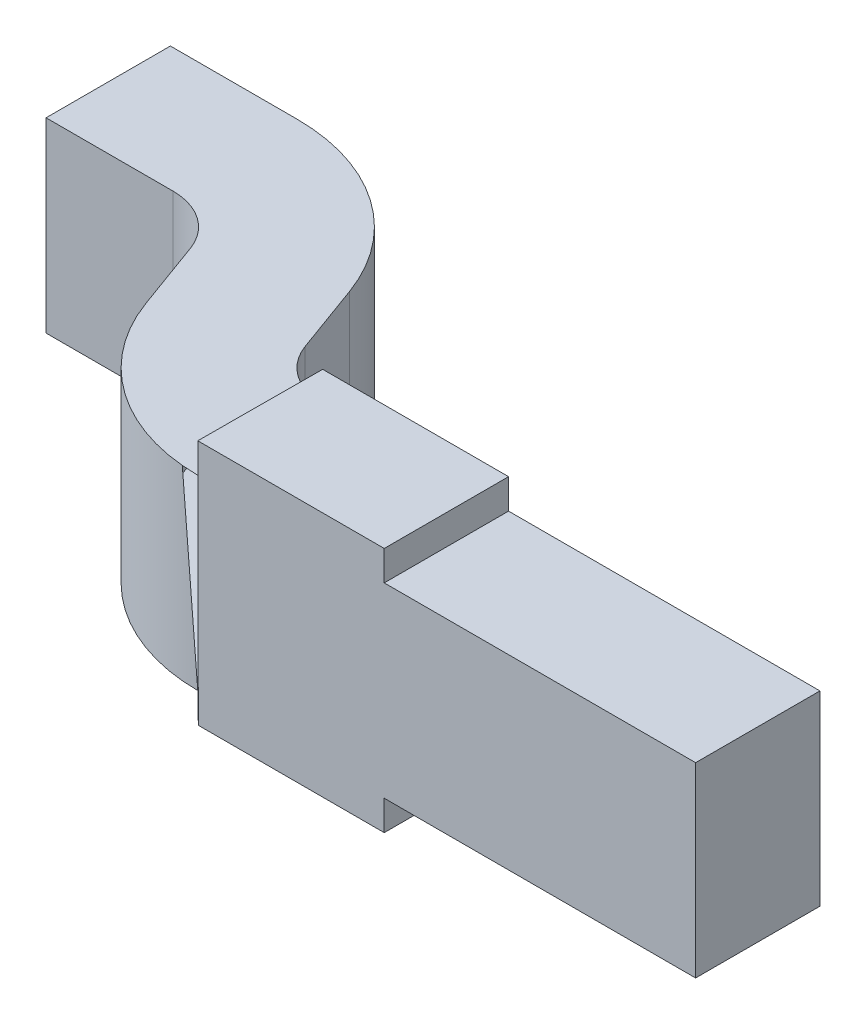
ISO-10303-21;
HEADER;
FILE_DESCRIPTION(('STEP AP214'),'2;1');
FILE_NAME('part.step','',(''),(''),'','','');
FILE_SCHEMA(('AUTOMOTIVE_DESIGN { 1 0 10303 214 1 1 1 1 }'));
ENDSEC;
DATA;
#1=APPLICATION_CONTEXT('core data for automotive mechanical design processes');
#2=APPLICATION_PROTOCOL_DEFINITION('international standard','automotive_design',2000,#1);
#3=PRODUCT_CONTEXT('',#1,'mechanical');
#4=PRODUCT('Part','Part','',(#3));
#5=PRODUCT_RELATED_PRODUCT_CATEGORY('part','',(#4));
#6=PRODUCT_DEFINITION_FORMATION('','',#4);
#7=PRODUCT_DEFINITION_CONTEXT('part definition',#1,'design');
#8=PRODUCT_DEFINITION('design','',#6,#7);
#9=PRODUCT_DEFINITION_SHAPE('','',#8);
#10=(LENGTH_UNIT() NAMED_UNIT(*) SI_UNIT(.MILLI.,.METRE.));
#11=(NAMED_UNIT(*) PLANE_ANGLE_UNIT() SI_UNIT($,.RADIAN.));
#12=(NAMED_UNIT(*) SI_UNIT($,.STERADIAN.) SOLID_ANGLE_UNIT());
#13=UNCERTAINTY_MEASURE_WITH_UNIT(LENGTH_MEASURE(1.E-05),#10,'distance_accuracy_value','');
#14=(GEOMETRIC_REPRESENTATION_CONTEXT(3) GLOBAL_UNCERTAINTY_ASSIGNED_CONTEXT((#13)) GLOBAL_UNIT_ASSIGNED_CONTEXT((#10,
#11,#12)) REPRESENTATION_CONTEXT('',''));
#15=CARTESIAN_POINT('',(0.,0.,0.));
#16=DIRECTION('',(0.,0.,1.));
#17=DIRECTION('',(1.,0.,0.));
#18=AXIS2_PLACEMENT_3D('',#15,#16,#17);
#19=CARTESIAN_POINT('',(195.3553175894,103.43704329235,113.086328634145));
#20=DIRECTION('',(0.,1.,0.));
#21=DIRECTION('',(1.,0.,0.));
#22=AXIS2_PLACEMENT_3D('',#19,#20,#21);
#23=PLANE('',#22);
#24=DIRECTION('',(-1.,0.,0.));
#25=VECTOR('',#24,1.);
#26=CARTESIAN_POINT('',(197.209042943722,103.43704329235,113.151470551509));
#27=LINE('',#26,#25);
#28=CARTESIAN_POINT('',(197.209042943722,103.43704329235,113.151470551509));
#29=VERTEX_POINT('',#28);
#30=CARTESIAN_POINT('',(195.956744279938,103.43704329235,113.151470551509));
#31=VERTEX_POINT('',#30);
#32=EDGE_CURVE('E67',#29,#31,#27,.T.);
#33=ORIENTED_EDGE('',*,*,#32,.F.);
#34=DIRECTION('',(0.,0.,-1.));
#35=VECTOR('',#34,1.);
#36=CARTESIAN_POINT('',(197.209042943722,103.43704329235,113.651470551509));
#37=LINE('',#36,#35);
#38=CARTESIAN_POINT('',(197.209042943722,103.43704329235,113.651470551509));
#39=VERTEX_POINT('',#38);
#40=EDGE_CURVE('E354',#39,#29,#37,.T.);
#41=ORIENTED_EDGE('',*,*,#40,.F.);
#42=DIRECTION('',(1.,0.,0.));
#43=VECTOR('',#42,1.);
#44=CARTESIAN_POINT('',(195.209042943722,103.43704329235,113.651470551509));
#45=LINE('',#44,#43);
#46=CARTESIAN_POINT('',(195.956744279938,103.43704329235,113.651470551509));
#47=VERTEX_POINT('',#46);
#48=EDGE_CURVE('E318',#47,#39,#45,.T.);
#49=ORIENTED_EDGE('',*,*,#48,.F.);
#50=DIRECTION('',(0.,0.,-1.));
#51=VECTOR('',#50,1.);
#52=CARTESIAN_POINT('',(195.956744279938,103.43704329235,112.648955771372));
#53=LINE('',#52,#51);
#54=EDGE_CURVE('E11',#47,#31,#53,.T.);
#55=ORIENTED_EDGE('',*,*,#54,.T.);
#56=EDGE_LOOP('',(#33,#41,#49,#55));
#57=FACE_BOUND('',#56,.T.);
#58=ADVANCED_FACE('F44',(#57),#23,.F.);
#59=CARTESIAN_POINT('',(195.956744279938,104.78204329235,112.211582908599));
#60=DIRECTION('',(1.,0.,0.));
#61=DIRECTION('',(0.,1.,0.));
#62=AXIS2_PLACEMENT_3D('',#59,#60,#61);
#63=PLANE('',#62);
#64=ORIENTED_EDGE('',*,*,#54,.F.);
#65=DIRECTION('',(0.,1.,0.));
#66=VECTOR('',#65,1.);
#67=CARTESIAN_POINT('',(195.956744279938,104.54454329235,113.651470551509));
#68=LINE('',#67,#66);
#69=CARTESIAN_POINT('',(195.956744279938,103.31704329235,113.651470551509));
#70=VERTEX_POINT('',#69);
#71=EDGE_CURVE('E218',#70,#47,#68,.T.);
#72=ORIENTED_EDGE('',*,*,#71,.F.);
#73=DIRECTION('',(0.,0.,-1.));
#74=VECTOR('',#73,1.);
#75=CARTESIAN_POINT('',(195.956744279938,103.31704329235,112.648955771372));
#76=LINE('',#75,#74);
#77=CARTESIAN_POINT('',(195.956744279938,103.31704329235,113.151470551509));
#78=VERTEX_POINT('',#77);
#79=EDGE_CURVE('E55',#70,#78,#76,.T.);
#80=ORIENTED_EDGE('',*,*,#79,.T.);
#81=DIRECTION('',(0.,-1.,0.));
#82=VECTOR('',#81,1.);
#83=CARTESIAN_POINT('',(195.956744279938,104.54454329235,113.151470551509));
#84=LINE('',#83,#82);
#85=EDGE_CURVE('E202',#31,#78,#84,.T.);
#86=ORIENTED_EDGE('',*,*,#85,.F.);
#87=EDGE_LOOP('',(#64,#72,#80,#86));
#88=FACE_BOUND('',#87,.T.);
#89=ADVANCED_FACE('F216',(#88),#63,.T.);
#90=CARTESIAN_POINT('',(195.3553175894,103.31704329235,113.086328634145));
#91=DIRECTION('',(0.,1.,0.));
#92=DIRECTION('',(1.,0.,0.));
#93=AXIS2_PLACEMENT_3D('',#90,#91,#92);
#94=PLANE('',#93);
#95=DIRECTION('',(-1.,0.,0.));
#96=VECTOR('',#95,1.);
#97=CARTESIAN_POINT('',(197.209042943722,103.31704329235,113.151470551509));
#98=LINE('',#97,#96);
#99=CARTESIAN_POINT('',(195.209042943722,103.31704329235,113.151470551509));
#100=VERTEX_POINT('',#99);
#101=EDGE_CURVE('E208',#78,#100,#98,.T.);
#102=ORIENTED_EDGE('',*,*,#101,.F.);
#103=ORIENTED_EDGE('',*,*,#79,.F.);
#104=DIRECTION('',(1.,0.,0.));
#105=VECTOR('',#104,1.);
#106=CARTESIAN_POINT('',(195.209042943722,103.31704329235,113.651470551509));
#107=LINE('',#106,#105);
#108=CARTESIAN_POINT('',(195.209042943722,103.31704329235,113.651470551509));
#109=VERTEX_POINT('',#108);
#110=EDGE_CURVE('E418',#109,#70,#107,.T.);
#111=ORIENTED_EDGE('',*,*,#110,.F.);
#112=DIRECTION('',(0.,0.,1.));
#113=VECTOR('',#112,1.);
#114=CARTESIAN_POINT('',(195.206744279938,103.31704329235,112.648955771372));
#115=LINE('',#114,#113);
#116=EDGE_CURVE('E222',#100,#109,#115,.T.);
#117=ORIENTED_EDGE('',*,*,#116,.F.);
#118=EDGE_LOOP('',(#102,#103,#111,#117));
#119=FACE_BOUND('',#118,.T.);
#120=ADVANCED_FACE('F224',(#119),#94,.F.);
#121=CARTESIAN_POINT('',(195.206744279938,98.2820432923502,112.211582908599));
#122=DIRECTION('',(-1.,0.,0.));
#123=DIRECTION('',(0.,0.,1.));
#124=AXIS2_PLACEMENT_3D('',#121,#122,#123);
#125=PLANE('',#124);
#126=DIRECTION('',(0.,0.,1.));
#127=VECTOR('',#126,1.);
#128=CARTESIAN_POINT('',(195.206744279938,103.43704329235,112.648955771372));
#129=LINE('',#128,#127);
#130=CARTESIAN_POINT('',(195.206744279938,103.43704329235,113.151459983575));
#131=VERTEX_POINT('',#130);
#132=CARTESIAN_POINT('',(195.206744279938,103.43704329235,113.651467028931));
#133=VERTEX_POINT('',#132);
#134=EDGE_CURVE('E366',#131,#133,#129,.T.);
#135=ORIENTED_EDGE('',*,*,#134,.F.);
#136=DIRECTION('',(0.,1.,0.));
#137=VECTOR('',#136,1.);
#138=CARTESIAN_POINT('',(195.206744279938,104.30704329235,113.151459983575));
#139=LINE('',#138,#137);
#140=EDGE_CURVE('E234',#100,#131,#139,.T.);
#141=ORIENTED_EDGE('',*,*,#140,.F.);
#142=ORIENTED_EDGE('',*,*,#116,.T.);
#143=DIRECTION('',(0.,1.,0.));
#144=VECTOR('',#143,1.);
#145=CARTESIAN_POINT('',(195.206744279938,104.30704329235,113.651467028931));
#146=LINE('',#145,#144);
#147=EDGE_CURVE('E369',#109,#133,#146,.T.);
#148=ORIENTED_EDGE('',*,*,#147,.T.);
#149=EDGE_LOOP('',(#135,#141,#142,#148));
#150=FACE_BOUND('',#149,.T.);
#151=ADVANCED_FACE('F511',(#150),#125,.T.);
#152=CARTESIAN_POINT('',(195.3553175894,103.43704329235,113.086328634145));
#153=DIRECTION('',(0.,1.,0.));
#154=DIRECTION('',(1.,0.,0.));
#155=AXIS2_PLACEMENT_3D('',#152,#153,#154);
#156=PLANE('',#155);
#157=DIRECTION('',(-1.,0.,0.));
#158=VECTOR('',#157,1.);
#159=CARTESIAN_POINT('',(194.166744279938,103.43704329235,112.211582908599));
#160=LINE('',#159,#158);
#161=CARTESIAN_POINT('',(194.166744279938,103.43704329235,112.211582908599));
#162=VERTEX_POINT('',#161);
#163=CARTESIAN_POINT('',(193.656744279938,103.43704329235,112.211582908599));
#164=VERTEX_POINT('',#163);
#165=EDGE_CURVE('E396',#162,#164,#160,.T.);
#166=ORIENTED_EDGE('',*,*,#165,.F.);
#167=CARTESIAN_POINT('',(194.166744279938,103.43704329235,112.961582908599));
#168=DIRECTION('',(0.,1.,0.));
#169=DIRECTION('',(0.939692620785816,0.,-0.342020143325922));
#170=AXIS2_PLACEMENT_3D('',#167,#168,#169);
#171=CIRCLE('',#170,0.75);
#172=CARTESIAN_POINT('',(194.871513745527,103.43704329235,112.705067801105));
#173=VERTEX_POINT('',#172);
#174=EDGE_CURVE('E357',#173,#162,#171,.T.);
#175=ORIENTED_EDGE('',*,*,#174,.F.);
#176=DIRECTION('',(-0.342020143325932,0.,-0.939692620785813));
#177=VECTOR('',#176,1.);
#178=CARTESIAN_POINT('',(194.974119788525,103.43704329235,112.986975587341));
#179=LINE('',#178,#177);
#180=CARTESIAN_POINT('',(194.974119788525,103.43704329235,112.986975587341));
#181=VERTEX_POINT('',#180);
#182=EDGE_CURVE('E305',#181,#173,#179,.T.);
#183=ORIENTED_EDGE('',*,*,#182,.F.);
#184=CARTESIAN_POINT('',(195.209042943722,103.43704329235,112.901470551509));
#185=DIRECTION('',(0.,-1.,0.));
#186=DIRECTION('',(0.,0.,1.));
#187=AXIS2_PLACEMENT_3D('',#184,#185,#186);
#188=CIRCLE('',#187,0.25);
#189=EDGE_CURVE('E270',#131,#181,#188,.T.);
#190=ORIENTED_EDGE('',*,*,#189,.F.);
#191=ORIENTED_EDGE('',*,*,#134,.T.);
#192=CARTESIAN_POINT('',(195.209042943722,103.43704329235,112.901470551509));
#193=DIRECTION('',(0.,1.,0.));
#194=DIRECTION('',(-0.939692620785816,0.,0.342020143325922));
#195=AXIS2_PLACEMENT_3D('',#192,#193,#194);
#196=CIRCLE('',#195,0.75);
#197=CARTESIAN_POINT('',(194.504273478132,103.43704329235,113.157985659003));
#198=VERTEX_POINT('',#197);
#199=EDGE_CURVE('E325',#198,#133,#196,.T.);
#200=ORIENTED_EDGE('',*,*,#199,.F.);
#201=DIRECTION('',(0.342020143325932,0.,0.939692620785813));
#202=VECTOR('',#201,1.);
#203=CARTESIAN_POINT('',(194.401667435134,103.43704329235,112.876077872768));
#204=LINE('',#203,#202);
#205=CARTESIAN_POINT('',(194.401667435134,103.43704329235,112.876077872768));
#206=VERTEX_POINT('',#205);
#207=EDGE_CURVE('E314',#206,#198,#204,.T.);
#208=ORIENTED_EDGE('',*,*,#207,.F.);
#209=CARTESIAN_POINT('',(194.166744279938,103.43704329235,112.961582908599));
#210=DIRECTION('',(0.,-1.,0.));
#211=DIRECTION('',(0.,0.,-1.));
#212=AXIS2_PLACEMENT_3D('',#209,#210,#211);
#213=CIRCLE('',#212,0.25);
#214=CARTESIAN_POINT('',(194.166744279938,103.43704329235,112.711582908599));
#215=VERTEX_POINT('',#214);
#216=EDGE_CURVE('E292',#215,#206,#213,.T.);
#217=ORIENTED_EDGE('',*,*,#216,.F.);
#218=DIRECTION('',(1.,0.,0.));
#219=VECTOR('',#218,1.);
#220=CARTESIAN_POINT('',(193.656744279938,103.43704329235,112.711582908599));
#221=LINE('',#220,#219);
#222=CARTESIAN_POINT('',(193.656744279938,103.43704329235,112.711582908599));
#223=VERTEX_POINT('',#222);
#224=EDGE_CURVE('E291',#223,#215,#221,.T.);
#225=ORIENTED_EDGE('',*,*,#224,.F.);
#226=DIRECTION('',(0.,0.,1.));
#227=VECTOR('',#226,1.);
#228=CARTESIAN_POINT('',(193.656744279938,103.43704329235,112.211582908599));
#229=LINE('',#228,#227);
#230=EDGE_CURVE('E330',#164,#223,#229,.T.);
#231=ORIENTED_EDGE('',*,*,#230,.F.);
#232=EDGE_LOOP('',(#166,#175,#183,#190,#191,#200,#208,#217,#225,#231));
#233=FACE_BOUND('',#232,.T.);
#234=ADVANCED_FACE('F461',(#233),#156,.F.);
#235=CARTESIAN_POINT('',(193.656744279938,104.18704329235,112.711582908599));
#236=DIRECTION('',(0.,0.,1.));
#237=DIRECTION('',(1.,0.,0.));
#238=AXIS2_PLACEMENT_3D('',#235,#236,#237);
#239=PLANE('',#238);
#240=DIRECTION('',(0.,-1.,0.));
#241=VECTOR('',#240,1.);
#242=CARTESIAN_POINT('',(193.656744279938,104.18704329235,112.711582908599));
#243=LINE('',#242,#241);
#244=CARTESIAN_POINT('',(193.656744279938,104.18704329235,112.711582908599));
#245=VERTEX_POINT('',#244);
#246=EDGE_CURVE('E370',#245,#223,#243,.T.);
#247=ORIENTED_EDGE('',*,*,#246,.T.);
#248=ORIENTED_EDGE('',*,*,#224,.T.);
#249=DIRECTION('',(0.,-1.,0.));
#250=VECTOR('',#249,1.);
#251=CARTESIAN_POINT('',(194.166744279938,104.18704329235,112.711582908599));
#252=LINE('',#251,#250);
#253=CARTESIAN_POINT('',(194.166744279938,104.18704329235,112.711582908599));
#254=VERTEX_POINT('',#253);
#255=EDGE_CURVE('E288',#254,#215,#252,.T.);
#256=ORIENTED_EDGE('',*,*,#255,.F.);
#257=DIRECTION('',(1.,0.,0.));
#258=VECTOR('',#257,1.);
#259=CARTESIAN_POINT('',(193.656744279938,104.18704329235,112.711582908599));
#260=LINE('',#259,#258);
#261=EDGE_CURVE('E339',#245,#254,#260,.T.);
#262=ORIENTED_EDGE('',*,*,#261,.F.);
#263=EDGE_LOOP('',(#247,#248,#256,#262));
#264=FACE_BOUND('',#263,.T.);
#265=ADVANCED_FACE('F468',(#264),#239,.T.);
#266=CARTESIAN_POINT('',(194.166744279938,104.18704329235,112.961582908599));
#267=DIRECTION('',(0.,1.,0.));
#268=DIRECTION('',(0.,0.,-1.));
#269=AXIS2_PLACEMENT_3D('',#266,#267,#268);
#270=CYLINDRICAL_SURFACE('',#269,0.25);
#271=ORIENTED_EDGE('',*,*,#255,.T.);
#272=ORIENTED_EDGE('',*,*,#216,.T.);
#273=DIRECTION('',(0.,-1.,0.));
#274=VECTOR('',#273,1.);
#275=CARTESIAN_POINT('',(194.401667435134,104.18704329235,112.876077872768));
#276=LINE('',#275,#274);
#277=CARTESIAN_POINT('',(194.401667435134,104.18704329235,112.876077872768));
#278=VERTEX_POINT('',#277);
#279=EDGE_CURVE('E296',#278,#206,#276,.T.);
#280=ORIENTED_EDGE('',*,*,#279,.F.);
#281=CARTESIAN_POINT('',(194.166744279938,104.18704329235,112.961582908599));
#282=DIRECTION('',(0.,-1.,0.));
#283=DIRECTION('',(0.,0.,-1.));
#284=AXIS2_PLACEMENT_3D('',#281,#282,#283);
#285=CIRCLE('',#284,0.25);
#286=EDGE_CURVE('E343',#254,#278,#285,.T.);
#287=ORIENTED_EDGE('',*,*,#286,.F.);
#288=EDGE_LOOP('',(#271,#272,#280,#287));
#289=FACE_BOUND('',#288,.T.);
#290=ADVANCED_FACE('F464',(#289),#270,.F.);
#291=CARTESIAN_POINT('',(194.401667435134,104.18704329235,112.876077872768));
#292=DIRECTION('',(-0.939692620785813,0.,0.342020143325932));
#293=DIRECTION('',(0.,1.,0.));
#294=AXIS2_PLACEMENT_3D('',#291,#292,#293);
#295=PLANE('',#294);
#296=ORIENTED_EDGE('',*,*,#279,.T.);
#297=ORIENTED_EDGE('',*,*,#207,.T.);
#298=DIRECTION('',(0.,-1.,0.));
#299=VECTOR('',#298,1.);
#300=CARTESIAN_POINT('',(194.504273478132,104.18704329235,113.157985659003));
#301=LINE('',#300,#299);
#302=CARTESIAN_POINT('',(194.504273478132,104.18704329235,113.157985659003));
#303=VERTEX_POINT('',#302);
#304=EDGE_CURVE('E256',#303,#198,#301,.T.);
#305=ORIENTED_EDGE('',*,*,#304,.F.);
#306=DIRECTION('',(0.342020143325932,0.,0.939692620785813));
#307=VECTOR('',#306,1.);
#308=CARTESIAN_POINT('',(194.401667435134,104.18704329235,112.876077872768));
#309=LINE('',#308,#307);
#310=EDGE_CURVE('E352',#278,#303,#309,.T.);
#311=ORIENTED_EDGE('',*,*,#310,.F.);
#312=EDGE_LOOP('',(#296,#297,#305,#311));
#313=FACE_BOUND('',#312,.T.);
#314=ADVANCED_FACE('F458',(#313),#295,.T.);
#315=CARTESIAN_POINT('',(194.974119788525,104.18704329235,112.986975587341));
#316=DIRECTION('',(0.939692620785813,0.,-0.342020143325932));
#317=DIRECTION('',(0.,-1.,0.));
#318=AXIS2_PLACEMENT_3D('',#315,#316,#317);
#319=PLANE('',#318);
#320=DIRECTION('',(0.,-1.,0.));
#321=VECTOR('',#320,1.);
#322=CARTESIAN_POINT('',(194.974119788525,104.18704329235,112.986975587341));
#323=LINE('',#322,#321);
#324=CARTESIAN_POINT('',(194.974119788525,104.18704329235,112.986975587341));
#325=VERTEX_POINT('',#324);
#326=EDGE_CURVE('E309',#325,#181,#323,.T.);
#327=ORIENTED_EDGE('',*,*,#326,.T.);
#328=ORIENTED_EDGE('',*,*,#182,.T.);
#329=DIRECTION('',(0.,-1.,0.));
#330=VECTOR('',#329,1.);
#331=CARTESIAN_POINT('',(194.871513745527,104.18704329235,112.705067801105));
#332=LINE('',#331,#330);
#333=CARTESIAN_POINT('',(194.871513745527,104.18704329235,112.705067801105));
#334=VERTEX_POINT('',#333);
#335=EDGE_CURVE('E310',#334,#173,#332,.T.);
#336=ORIENTED_EDGE('',*,*,#335,.F.);
#337=DIRECTION('',(-0.342020143325932,0.,-0.939692620785813));
#338=VECTOR('',#337,1.);
#339=CARTESIAN_POINT('',(194.974119788525,104.18704329235,112.986975587341));
#340=LINE('',#339,#338);
#341=EDGE_CURVE('E365',#325,#334,#340,.T.);
#342=ORIENTED_EDGE('',*,*,#341,.F.);
#343=EDGE_LOOP('',(#327,#328,#336,#342));
#344=FACE_BOUND('',#343,.T.);
#345=ADVANCED_FACE('F485',(#344),#319,.T.);
#346=CARTESIAN_POINT('',(194.166744279938,104.18704329235,112.961582908599));
#347=DIRECTION('',(0.,1.,0.));
#348=DIRECTION('',(0.939692620785816,0.,-0.342020143325922));
#349=AXIS2_PLACEMENT_3D('',#346,#347,#348);
#350=CYLINDRICAL_SURFACE('',#349,0.75);
#351=ORIENTED_EDGE('',*,*,#335,.T.);
#352=ORIENTED_EDGE('',*,*,#174,.T.);
#353=DIRECTION('',(0.,-1.,0.));
#354=VECTOR('',#353,1.);
#355=CARTESIAN_POINT('',(194.166744279938,104.18704329235,112.211582908599));
#356=LINE('',#355,#354);
#357=CARTESIAN_POINT('',(194.166744279938,104.18704329235,112.211582908599));
#358=VERTEX_POINT('',#357);
#359=EDGE_CURVE('E361',#358,#162,#356,.T.);
#360=ORIENTED_EDGE('',*,*,#359,.F.);
#361=CARTESIAN_POINT('',(194.166744279938,104.18704329235,112.961582908599));
#362=DIRECTION('',(0.,1.,0.));
#363=DIRECTION('',(0.939692620785816,0.,-0.342020143325922));
#364=AXIS2_PLACEMENT_3D('',#361,#362,#363);
#365=CIRCLE('',#364,0.75);
#366=EDGE_CURVE('E300',#334,#358,#365,.T.);
#367=ORIENTED_EDGE('',*,*,#366,.F.);
#368=EDGE_LOOP('',(#351,#352,#360,#367));
#369=FACE_BOUND('',#368,.T.);
#370=ADVANCED_FACE('F482',(#369),#350,.T.);
#371=CARTESIAN_POINT('',(194.166744279938,104.18704329235,112.211582908599));
#372=DIRECTION('',(0.,0.,-1.));
#373=DIRECTION('',(0.,-1.,0.));
#374=AXIS2_PLACEMENT_3D('',#371,#372,#373);
#375=PLANE('',#374);
#376=ORIENTED_EDGE('',*,*,#359,.T.);
#377=ORIENTED_EDGE('',*,*,#165,.T.);
#378=DIRECTION('',(0.,-1.,0.));
#379=VECTOR('',#378,1.);
#380=CARTESIAN_POINT('',(193.656744279938,104.18704329235,112.211582908599));
#381=LINE('',#380,#379);
#382=CARTESIAN_POINT('',(193.656744279938,104.18704329235,112.211582908599));
#383=VERTEX_POINT('',#382);
#384=EDGE_CURVE('E333',#383,#164,#381,.T.);
#385=ORIENTED_EDGE('',*,*,#384,.F.);
#386=DIRECTION('',(-1.,0.,0.));
#387=VECTOR('',#386,1.);
#388=CARTESIAN_POINT('',(194.166744279938,104.18704329235,112.211582908599));
#389=LINE('',#388,#387);
#390=EDGE_CURVE('E297',#358,#383,#389,.T.);
#391=ORIENTED_EDGE('',*,*,#390,.F.);
#392=EDGE_LOOP('',(#376,#377,#385,#391));
#393=FACE_BOUND('',#392,.T.);
#394=ADVANCED_FACE('F474',(#393),#375,.T.);
#395=CARTESIAN_POINT('',(193.656744279938,104.18704329235,112.211582908599));
#396=DIRECTION('',(-1.,0.,0.));
#397=DIRECTION('',(0.,1.,0.));
#398=AXIS2_PLACEMENT_3D('',#395,#396,#397);
#399=PLANE('',#398);
#400=ORIENTED_EDGE('',*,*,#384,.T.);
#401=ORIENTED_EDGE('',*,*,#230,.T.);
#402=ORIENTED_EDGE('',*,*,#246,.F.);
#403=DIRECTION('',(0.,0.,1.));
#404=VECTOR('',#403,1.);
#405=CARTESIAN_POINT('',(193.656744279938,104.18704329235,112.211582908599));
#406=LINE('',#405,#404);
#407=EDGE_CURVE('E342',#383,#245,#406,.T.);
#408=ORIENTED_EDGE('',*,*,#407,.F.);
#409=EDGE_LOOP('',(#400,#401,#402,#408));
#410=FACE_BOUND('',#409,.T.);
#411=ADVANCED_FACE('F478',(#410),#399,.T.);
#412=CARTESIAN_POINT('',(197.209042943722,104.18704329235,113.651470551509));
#413=DIRECTION('',(1.,0.,0.));
#414=DIRECTION('',(0.,1.,0.));
#415=AXIS2_PLACEMENT_3D('',#412,#413,#414);
#416=PLANE('',#415);
#417=DIRECTION('',(0.,-1.,0.));
#418=VECTOR('',#417,1.);
#419=CARTESIAN_POINT('',(197.209042943722,104.18704329235,113.651470551509));
#420=LINE('',#419,#418);
#421=CARTESIAN_POINT('',(197.209042943722,104.18704329235,113.651470551509));
#422=VERTEX_POINT('',#421);
#423=EDGE_CURVE('E334',#422,#39,#420,.T.);
#424=ORIENTED_EDGE('',*,*,#423,.T.);
#425=ORIENTED_EDGE('',*,*,#40,.T.);
#426=DIRECTION('',(0.,-1.,0.));
#427=VECTOR('',#426,1.);
#428=CARTESIAN_POINT('',(197.209042943722,104.18704329235,113.151470551509));
#429=LINE('',#428,#427);
#430=CARTESIAN_POINT('',(197.209042943722,104.18704329235,113.151470551509));
#431=VERTEX_POINT('',#430);
#432=EDGE_CURVE('E311',#431,#29,#429,.T.);
#433=ORIENTED_EDGE('',*,*,#432,.F.);
#434=DIRECTION('',(0.,0.,-1.));
#435=VECTOR('',#434,1.);
#436=CARTESIAN_POINT('',(197.209042943722,104.18704329235,113.651470551509));
#437=LINE('',#436,#435);
#438=EDGE_CURVE('E347',#422,#431,#437,.T.);
#439=ORIENTED_EDGE('',*,*,#438,.F.);
#440=EDGE_LOOP('',(#424,#425,#433,#439));
#441=FACE_BOUND('',#440,.T.);
#442=ADVANCED_FACE('F541',(#441),#416,.T.);
#443=CARTESIAN_POINT('',(195.3553175894,104.18704329235,113.086328634145));
#444=DIRECTION('',(0.,1.,0.));
#445=DIRECTION('',(1.,0.,0.));
#446=AXIS2_PLACEMENT_3D('',#443,#444,#445);
#447=PLANE('',#446);
#448=ORIENTED_EDGE('',*,*,#407,.T.);
#449=ORIENTED_EDGE('',*,*,#261,.T.);
#450=ORIENTED_EDGE('',*,*,#286,.T.);
#451=ORIENTED_EDGE('',*,*,#310,.T.);
#452=CARTESIAN_POINT('',(195.209042943722,104.18704329235,112.901470551509));
#453=DIRECTION('',(0.,1.,0.));
#454=DIRECTION('',(-0.939692620785816,0.,0.342020143325922));
#455=AXIS2_PLACEMENT_3D('',#452,#453,#454);
#456=CIRCLE('',#455,0.75);
#457=CARTESIAN_POINT('',(195.206744279938,104.18704329235,113.651467028931));
#458=VERTEX_POINT('',#457);
#459=EDGE_CURVE('E348',#303,#458,#456,.T.);
#460=ORIENTED_EDGE('',*,*,#459,.T.);
#461=DIRECTION('',(0.,0.,1.));
#462=VECTOR('',#461,1.);
#463=CARTESIAN_POINT('',(195.206744279938,104.18704329235,112.648955771372));
#464=LINE('',#463,#462);
#465=CARTESIAN_POINT('',(195.206744279938,104.18704329235,113.151459983575));
#466=VERTEX_POINT('',#465);
#467=EDGE_CURVE('E255',#466,#458,#464,.T.);
#468=ORIENTED_EDGE('',*,*,#467,.F.);
#469=CARTESIAN_POINT('',(195.209042943722,104.18704329235,112.901470551509));
#470=DIRECTION('',(0.,-1.,0.));
#471=DIRECTION('',(0.,0.,1.));
#472=AXIS2_PLACEMENT_3D('',#469,#470,#471);
#473=CIRCLE('',#472,0.25);
#474=EDGE_CURVE('E353',#466,#325,#473,.T.);
#475=ORIENTED_EDGE('',*,*,#474,.T.);
#476=ORIENTED_EDGE('',*,*,#341,.T.);
#477=ORIENTED_EDGE('',*,*,#366,.T.);
#478=ORIENTED_EDGE('',*,*,#390,.T.);
#479=EDGE_LOOP('',(#448,#449,#450,#451,#460,#468,#475,#476,#477,#478));
#480=FACE_BOUND('',#479,.T.);
#481=ADVANCED_FACE('F455',(#480),#447,.T.);
#482=CARTESIAN_POINT('',(195.3553175894,104.18704329235,113.086328634145));
#483=DIRECTION('',(0.,1.,0.));
#484=DIRECTION('',(1.,0.,0.));
#485=AXIS2_PLACEMENT_3D('',#482,#483,#484);
#486=PLANE('',#485);
#487=DIRECTION('',(0.,0.,-1.));
#488=VECTOR('',#487,1.);
#489=CARTESIAN_POINT('',(195.956744279938,104.18704329235,112.648955771372));
#490=LINE('',#489,#488);
#491=CARTESIAN_POINT('',(195.956744279938,104.18704329235,113.651470551509));
#492=VERTEX_POINT('',#491);
#493=CARTESIAN_POINT('',(195.956744279938,104.18704329235,113.151470551509));
#494=VERTEX_POINT('',#493);
#495=EDGE_CURVE('E326',#492,#494,#490,.T.);
#496=ORIENTED_EDGE('',*,*,#495,.F.);
#497=DIRECTION('',(1.,0.,0.));
#498=VECTOR('',#497,1.);
#499=CARTESIAN_POINT('',(195.209042943722,104.18704329235,113.651470551509));
#500=LINE('',#499,#498);
#501=EDGE_CURVE('E301',#492,#422,#500,.T.);
#502=ORIENTED_EDGE('',*,*,#501,.T.);
#503=ORIENTED_EDGE('',*,*,#438,.T.);
#504=DIRECTION('',(-1.,0.,0.));
#505=VECTOR('',#504,1.);
#506=CARTESIAN_POINT('',(197.209042943722,104.18704329235,113.151470551509));
#507=LINE('',#506,#505);
#508=EDGE_CURVE('E304',#431,#494,#507,.T.);
#509=ORIENTED_EDGE('',*,*,#508,.T.);
#510=EDGE_LOOP('',(#496,#502,#503,#509));
#511=FACE_BOUND('',#510,.T.);
#512=ADVANCED_FACE('F46',(#511),#486,.T.);
#513=CARTESIAN_POINT('',(195.206744279938,98.2820432923502,112.211582908599));
#514=DIRECTION('',(-1.,0.,0.));
#515=DIRECTION('',(0.,0.,1.));
#516=AXIS2_PLACEMENT_3D('',#513,#514,#515);
#517=PLANE('',#516);
#518=DIRECTION('',(0.,0.,1.));
#519=VECTOR('',#518,1.);
#520=CARTESIAN_POINT('',(195.206744279938,104.30704329235,112.648955771372));
#521=LINE('',#520,#519);
#522=CARTESIAN_POINT('',(195.209042943722,104.30704329235,113.151470551509));
#523=VERTEX_POINT('',#522);
#524=CARTESIAN_POINT('',(195.206744279938,104.30704329235,113.651467028931));
#525=VERTEX_POINT('',#524);
#526=EDGE_CURVE('E244',#523,#525,#521,.T.);
#527=ORIENTED_EDGE('',*,*,#526,.F.);
#528=DIRECTION('',(0.,1.,0.));
#529=VECTOR('',#528,1.);
#530=CARTESIAN_POINT('',(195.206744279938,104.30704329235,113.151459983575));
#531=LINE('',#530,#529);
#532=EDGE_CURVE('E247',#466,#523,#531,.T.);
#533=ORIENTED_EDGE('',*,*,#532,.F.);
#534=ORIENTED_EDGE('',*,*,#467,.T.);
#535=DIRECTION('',(0.,1.,0.));
#536=VECTOR('',#535,1.);
#537=CARTESIAN_POINT('',(195.206744279938,104.30704329235,113.651467028931));
#538=LINE('',#537,#536);
#539=EDGE_CURVE('E251',#458,#525,#538,.T.);
#540=ORIENTED_EDGE('',*,*,#539,.T.);
#541=EDGE_LOOP('',(#527,#533,#534,#540));
#542=FACE_BOUND('',#541,.T.);
#543=ADVANCED_FACE('F453',(#542),#517,.T.);
#544=CARTESIAN_POINT('',(195.209042943722,104.30704329235,112.901470551509));
#545=DIRECTION('',(0.,1.,0.));
#546=DIRECTION('',(-0.939692620785816,0.,0.342020143325922));
#547=AXIS2_PLACEMENT_3D('',#544,#545,#546);
#548=CYLINDRICAL_SURFACE('',#547,0.75);
#549=DIRECTION('',(0.,-1.,0.));
#550=VECTOR('',#549,1.);
#551=CARTESIAN_POINT('',(195.209042943722,104.30704329235,113.651470551509));
#552=LINE('',#551,#550);
#553=EDGE_CURVE('E338',#525,#109,#552,.T.);
#554=ORIENTED_EDGE('',*,*,#553,.F.);
#555=ORIENTED_EDGE('',*,*,#539,.F.);
#556=ORIENTED_EDGE('',*,*,#459,.F.);
#557=ORIENTED_EDGE('',*,*,#304,.T.);
#558=ORIENTED_EDGE('',*,*,#199,.T.);
#559=ORIENTED_EDGE('',*,*,#147,.F.);
#560=EDGE_LOOP('',(#554,#555,#556,#557,#558,#559));
#561=FACE_BOUND('',#560,.T.);
#562=ADVANCED_FACE('F449',(#561),#548,.T.);
#563=CARTESIAN_POINT('',(195.209042943722,104.30704329235,113.651470551509));
#564=DIRECTION('',(0.,0.,1.));
#565=DIRECTION('',(1.,0.,0.));
#566=AXIS2_PLACEMENT_3D('',#563,#564,#565);
#567=PLANE('',#566);
#568=DIRECTION('',(1.,0.,0.));
#569=VECTOR('',#568,1.);
#570=CARTESIAN_POINT('',(195.209042943722,104.30704329235,113.651470551509));
#571=LINE('',#570,#569);
#572=CARTESIAN_POINT('',(195.956744279938,104.30704329235,113.651470551509));
#573=VERTEX_POINT('',#572);
#574=EDGE_CURVE('E248',#525,#573,#571,.T.);
#575=ORIENTED_EDGE('',*,*,#574,.F.);
#576=ORIENTED_EDGE('',*,*,#553,.T.);
#577=ORIENTED_EDGE('',*,*,#110,.T.);
#578=ORIENTED_EDGE('',*,*,#71,.T.);
#579=ORIENTED_EDGE('',*,*,#48,.T.);
#580=ORIENTED_EDGE('',*,*,#423,.F.);
#581=ORIENTED_EDGE('',*,*,#501,.F.);
#582=DIRECTION('',(0.,1.,0.));
#583=VECTOR('',#582,1.);
#584=CARTESIAN_POINT('',(195.956744279938,104.54454329235,113.651470551509));
#585=LINE('',#584,#583);
#586=EDGE_CURVE('E321',#492,#573,#585,.T.);
#587=ORIENTED_EDGE('',*,*,#586,.T.);
#588=EDGE_LOOP('',(#575,#576,#577,#578,#579,#580,#581,#587));
#589=FACE_BOUND('',#588,.T.);
#590=ADVANCED_FACE('F445',(#589),#567,.T.);
#591=CARTESIAN_POINT('',(195.956744279938,104.78204329235,112.211582908599));
#592=DIRECTION('',(1.,0.,0.));
#593=DIRECTION('',(0.,1.,0.));
#594=AXIS2_PLACEMENT_3D('',#591,#592,#593);
#595=PLANE('',#594);
#596=DIRECTION('',(0.,0.,-1.));
#597=VECTOR('',#596,1.);
#598=CARTESIAN_POINT('',(195.956744279938,104.30704329235,112.648955771372));
#599=LINE('',#598,#597);
#600=CARTESIAN_POINT('',(195.956744279938,104.30704329235,113.151470551509));
#601=VERTEX_POINT('',#600);
#602=EDGE_CURVE('E261',#573,#601,#599,.T.);
#603=ORIENTED_EDGE('',*,*,#602,.F.);
#604=ORIENTED_EDGE('',*,*,#586,.F.);
#605=ORIENTED_EDGE('',*,*,#495,.T.);
#606=DIRECTION('',(0.,-1.,0.));
#607=VECTOR('',#606,1.);
#608=CARTESIAN_POINT('',(195.956744279938,104.54454329235,113.151470551509));
#609=LINE('',#608,#607);
#610=EDGE_CURVE('E287',#601,#494,#609,.T.);
#611=ORIENTED_EDGE('',*,*,#610,.F.);
#612=EDGE_LOOP('',(#603,#604,#605,#611));
#613=FACE_BOUND('',#612,.T.);
#614=ADVANCED_FACE('F496',(#613),#595,.T.);
#615=CARTESIAN_POINT('',(197.209042943722,104.30704329235,113.151470551509));
#616=DIRECTION('',(0.,0.,-1.));
#617=DIRECTION('',(-1.,0.,0.));
#618=AXIS2_PLACEMENT_3D('',#615,#616,#617);
#619=PLANE('',#618);
#620=DIRECTION('',(-1.,0.,0.));
#621=VECTOR('',#620,1.);
#622=CARTESIAN_POINT('',(197.209042943722,104.30704329235,113.151470551509));
#623=LINE('',#622,#621);
#624=EDGE_CURVE('E264',#601,#523,#623,.T.);
#625=ORIENTED_EDGE('',*,*,#624,.F.);
#626=ORIENTED_EDGE('',*,*,#610,.T.);
#627=ORIENTED_EDGE('',*,*,#508,.F.);
#628=ORIENTED_EDGE('',*,*,#432,.T.);
#629=ORIENTED_EDGE('',*,*,#32,.T.);
#630=ORIENTED_EDGE('',*,*,#85,.T.);
#631=ORIENTED_EDGE('',*,*,#101,.T.);
#632=DIRECTION('',(0.,-1.,0.));
#633=VECTOR('',#632,1.);
#634=CARTESIAN_POINT('',(195.209042943722,104.30704329235,113.151470551509));
#635=LINE('',#634,#633);
#636=EDGE_CURVE('E228',#523,#100,#635,.T.);
#637=ORIENTED_EDGE('',*,*,#636,.F.);
#638=EDGE_LOOP('',(#625,#626,#627,#628,#629,#630,#631,#637));
#639=FACE_BOUND('',#638,.T.);
#640=ADVANCED_FACE('F205',(#639),#619,.T.);
#641=CARTESIAN_POINT('',(195.209042943722,104.30704329235,112.901470551509));
#642=DIRECTION('',(0.,1.,0.));
#643=DIRECTION('',(0.,0.,1.));
#644=AXIS2_PLACEMENT_3D('',#641,#642,#643);
#645=CYLINDRICAL_SURFACE('',#644,0.25);
#646=ORIENTED_EDGE('',*,*,#636,.T.);
#647=ORIENTED_EDGE('',*,*,#140,.T.);
#648=ORIENTED_EDGE('',*,*,#189,.T.);
#649=ORIENTED_EDGE('',*,*,#326,.F.);
#650=ORIENTED_EDGE('',*,*,#474,.F.);
#651=ORIENTED_EDGE('',*,*,#532,.T.);
#652=EDGE_LOOP('',(#646,#647,#648,#649,#650,#651));
#653=FACE_BOUND('',#652,.T.);
#654=ADVANCED_FACE('F486',(#653),#645,.F.);
#655=CARTESIAN_POINT('',(195.3553175894,104.30704329235,113.086328634145));
#656=DIRECTION('',(0.,1.,0.));
#657=DIRECTION('',(1.,0.,0.));
#658=AXIS2_PLACEMENT_3D('',#655,#656,#657);
#659=PLANE('',#658);
#660=ORIENTED_EDGE('',*,*,#526,.T.);
#661=ORIENTED_EDGE('',*,*,#574,.T.);
#662=ORIENTED_EDGE('',*,*,#602,.T.);
#663=ORIENTED_EDGE('',*,*,#624,.T.);
#664=EDGE_LOOP('',(#660,#661,#662,#663));
#665=FACE_BOUND('',#664,.T.);
#666=ADVANCED_FACE('F488',(#665),#659,.T.);
#667=CLOSED_SHELL('',(#58,#89,#120,#151,#234,#265,#290,#314,#345,#370,#394,#411,#442,#481,#512,
#543,#562,#590,#614,#640,#654,#666));
#668=MANIFOLD_SOLID_BREP('B2',#667);
#669=ADVANCED_BREP_SHAPE_REPRESENTATION('',(#18,#668),#14);
#670=SHAPE_DEFINITION_REPRESENTATION(#9,#669);
ENDSEC;
END-ISO-10303-21;
